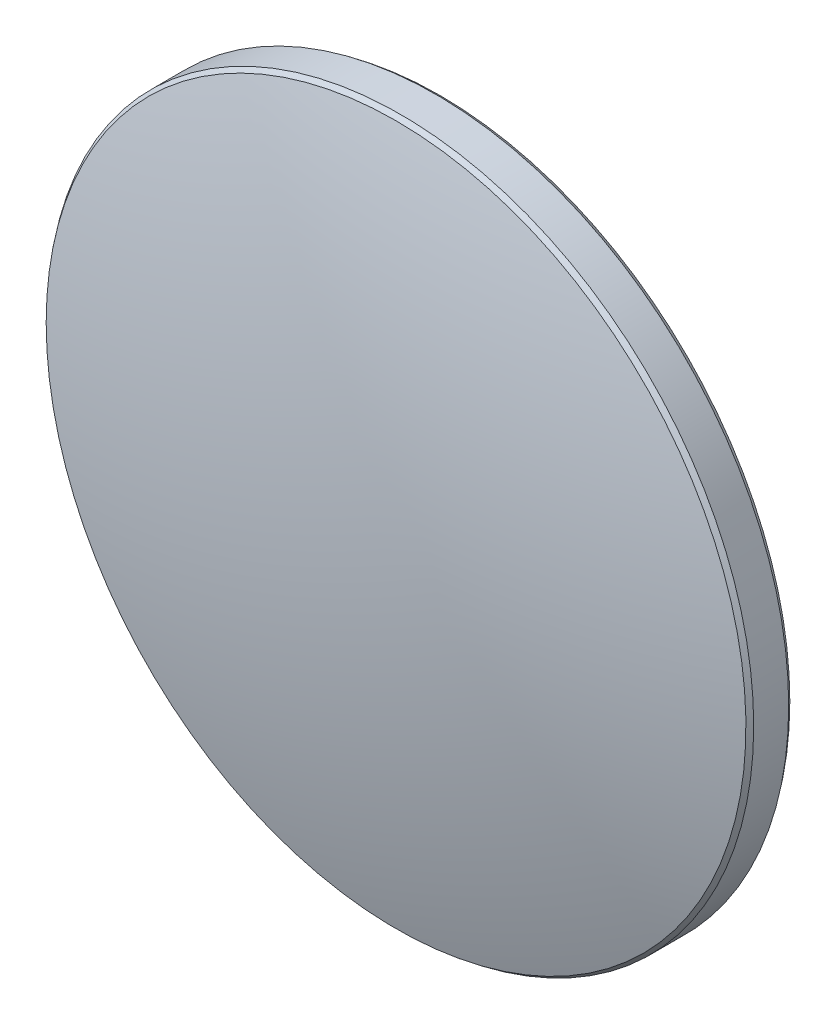
ISO-10303-21;
HEADER;
FILE_DESCRIPTION(('STEP AP214'),'2;1');
FILE_NAME('part.step','',(''),(''),'','','');
FILE_SCHEMA(('AUTOMOTIVE_DESIGN { 1 0 10303 214 1 1 1 1 }'));
ENDSEC;
DATA;
#1=APPLICATION_CONTEXT('core data for automotive mechanical design processes');
#2=APPLICATION_PROTOCOL_DEFINITION('international standard','automotive_design',2000,#1);
#3=PRODUCT_CONTEXT('',#1,'mechanical');
#4=PRODUCT('Part','Part','',(#3));
#5=PRODUCT_RELATED_PRODUCT_CATEGORY('part','',(#4));
#6=PRODUCT_DEFINITION_FORMATION('','',#4);
#7=PRODUCT_DEFINITION_CONTEXT('part definition',#1,'design');
#8=PRODUCT_DEFINITION('design','',#6,#7);
#9=PRODUCT_DEFINITION_SHAPE('','',#8);
#10=(LENGTH_UNIT() NAMED_UNIT(*) SI_UNIT(.MILLI.,.METRE.));
#11=(NAMED_UNIT(*) PLANE_ANGLE_UNIT() SI_UNIT($,.RADIAN.));
#12=(NAMED_UNIT(*) SI_UNIT($,.STERADIAN.) SOLID_ANGLE_UNIT());
#13=UNCERTAINTY_MEASURE_WITH_UNIT(LENGTH_MEASURE(1.E-05),#10,'distance_accuracy_value','');
#14=(GEOMETRIC_REPRESENTATION_CONTEXT(3) GLOBAL_UNCERTAINTY_ASSIGNED_CONTEXT((#13)) GLOBAL_UNIT_ASSIGNED_CONTEXT((#10,
#11,#12)) REPRESENTATION_CONTEXT('',''));
#15=CARTESIAN_POINT('',(0.,0.,0.));
#16=DIRECTION('',(0.,0.,1.));
#17=DIRECTION('',(1.,0.,0.));
#18=AXIS2_PLACEMENT_3D('',#15,#16,#17);
#19=CARTESIAN_POINT('',(0.,0.,-85.25));
#20=DIRECTION('',(0.,0.,1.));
#21=DIRECTION('',(0.,1.,0.));
#22=AXIS2_PLACEMENT_3D('',#19,#20,#21);
#23=SPHERICAL_SURFACE('',#22,90.4);
#24=CARTESIAN_POINT('',(0.,0.,1.57806856254719));
#25=DIRECTION('',(0.,0.,-1.));
#26=DIRECTION('',(-1.,0.,0.));
#27=AXIS2_PLACEMENT_3D('',#24,#25,#26);
#28=CIRCLE('',#27,25.1604155310998);
#29=CARTESIAN_POINT('',(-25.1604155310998,0.,1.57806856254719));
#30=VERTEX_POINT('',#29);
#31=EDGE_CURVE('E9',#30,#30,#28,.F.);
#32=ORIENTED_EDGE('',*,*,#31,.T.);
#33=EDGE_LOOP('',(#32));
#34=FACE_BOUND('',#33,.T.);
#35=ADVANCED_FACE('F13',(#34),#23,.T.);
#36=CARTESIAN_POINT('',(0.,0.,5.15));
#37=DIRECTION('',(0.,0.,1.));
#38=DIRECTION('',(1.,0.,0.));
#39=AXIS2_PLACEMENT_3D('',#36,#37,#38);
#40=CYLINDRICAL_SURFACE('',#39,25.4);
#41=CARTESIAN_POINT('',(0.,0.,-1.25828490697588));
#42=DIRECTION('',(0.,0.,1.));
#43=DIRECTION('',(1.,0.,0.));
#44=AXIS2_PLACEMENT_3D('',#41,#42,#43);
#45=CIRCLE('',#44,25.4);
#46=CARTESIAN_POINT('',(25.4,0.,-1.25828490697588));
#47=VERTEX_POINT('',#46);
#48=EDGE_CURVE('E24',#47,#47,#45,.T.);
#49=ORIENTED_EDGE('',*,*,#48,.T.);
#50=EDGE_LOOP('',(#49));
#51=FACE_BOUND('',#50,.T.);
#52=CARTESIAN_POINT('',(0.,0.,1.25828490697591));
#53=DIRECTION('',(0.,0.,-1.));
#54=DIRECTION('',(-1.,0.,0.));
#55=AXIS2_PLACEMENT_3D('',#52,#53,#54);
#56=CIRCLE('',#55,25.4);
#57=CARTESIAN_POINT('',(-25.4,0.,1.25828490697591));
#58=VERTEX_POINT('',#57);
#59=EDGE_CURVE('E28',#58,#58,#56,.T.);
#60=ORIENTED_EDGE('',*,*,#59,.T.);
#61=EDGE_LOOP('',(#60));
#62=FACE_BOUND('',#61,.T.);
#63=ADVANCED_FACE('F34',(#51,#62),#40,.T.);
#64=CARTESIAN_POINT('',(0.,0.,85.25));
#65=DIRECTION('',(0.,0.,1.));
#66=DIRECTION('',(0.,1.,0.));
#67=AXIS2_PLACEMENT_3D('',#64,#65,#66);
#68=SPHERICAL_SURFACE('',#67,90.4);
#69=CARTESIAN_POINT('',(0.,0.,-1.57806856254721));
#70=DIRECTION('',(0.,0.,1.));
#71=DIRECTION('',(1.,0.,0.));
#72=AXIS2_PLACEMENT_3D('',#69,#70,#71);
#73=CIRCLE('',#72,25.1604155310997);
#74=CARTESIAN_POINT('',(25.1604155310997,0.,-1.57806856254721));
#75=VERTEX_POINT('',#74);
#76=EDGE_CURVE('E20',#75,#75,#73,.F.);
#77=ORIENTED_EDGE('',*,*,#76,.T.);
#78=EDGE_LOOP('',(#77));
#79=FACE_BOUND('',#78,.T.);
#80=ADVANCED_FACE('F43',(#79),#68,.T.);
#81=CARTESIAN_POINT('',(0.,0.,-1.25828490697588));
#82=DIRECTION('',(0.,0.,1.));
#83=DIRECTION('',(1.,0.,0.));
#84=AXIS2_PLACEMENT_3D('',#81,#82,#83);
#85=CONICAL_SURFACE('',#84,25.4,0.642994027810142);
#86=ORIENTED_EDGE('',*,*,#76,.F.);
#87=EDGE_LOOP('',(#86));
#88=FACE_BOUND('',#87,.T.);
#89=ORIENTED_EDGE('',*,*,#48,.F.);
#90=EDGE_LOOP('',(#89));
#91=FACE_BOUND('',#90,.T.);
#92=ADVANCED_FACE('F38',(#88,#91),#85,.T.);
#93=CARTESIAN_POINT('',(0.,0.,1.57806856254719));
#94=DIRECTION('',(0.,0.,-1.));
#95=DIRECTION('',(-1.,0.,0.));
#96=AXIS2_PLACEMENT_3D('',#93,#94,#95);
#97=CONICAL_SURFACE('',#96,25.1604155310998,0.642994027810101);
#98=ORIENTED_EDGE('',*,*,#59,.F.);
#99=EDGE_LOOP('',(#98));
#100=FACE_BOUND('',#99,.T.);
#101=ORIENTED_EDGE('',*,*,#31,.F.);
#102=EDGE_LOOP('',(#101));
#103=FACE_BOUND('',#102,.T.);
#104=ADVANCED_FACE('F15',(#100,#103),#97,.T.);
#105=CLOSED_SHELL('',(#35,#63,#80,#92,#104));
#106=MANIFOLD_SOLID_BREP('B1',#105);
#107=ADVANCED_BREP_SHAPE_REPRESENTATION('',(#18,#106),#14);
#108=SHAPE_DEFINITION_REPRESENTATION(#9,#107);
ENDSEC;
END-ISO-10303-21;
